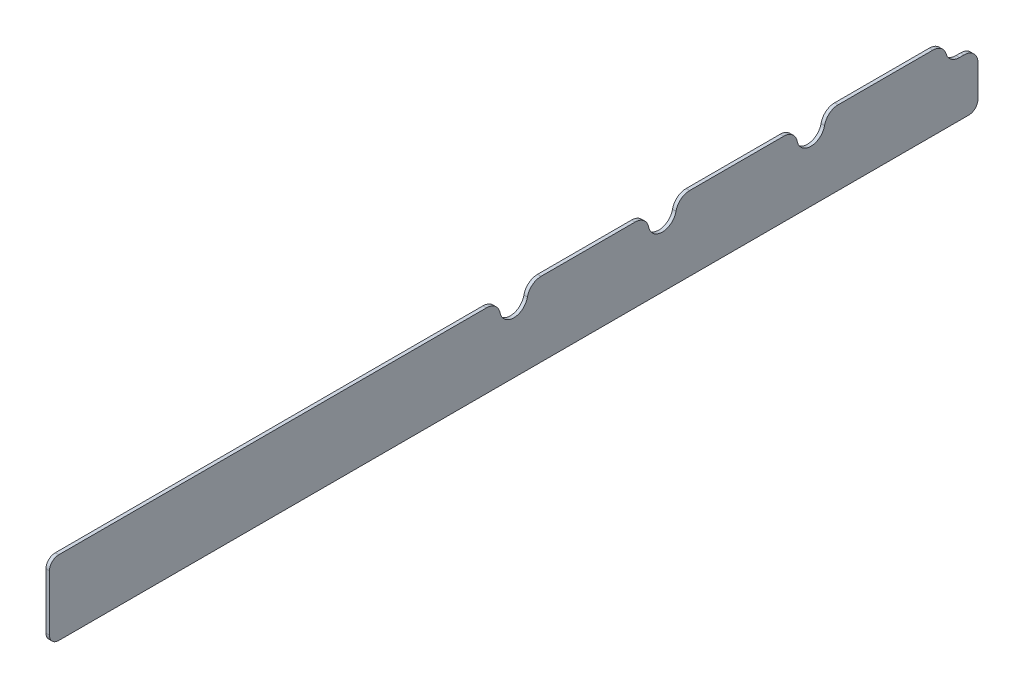
ISO-10303-21;
HEADER;
FILE_DESCRIPTION(('STEP AP214'),'2;1');
FILE_NAME('part.step','',(''),(''),'','','');
FILE_SCHEMA(('AUTOMOTIVE_DESIGN { 1 0 10303 214 1 1 1 1 }'));
ENDSEC;
DATA;
#1=APPLICATION_CONTEXT('core data for automotive mechanical design processes');
#2=APPLICATION_PROTOCOL_DEFINITION('international standard','automotive_design',2000,#1);
#3=PRODUCT_CONTEXT('',#1,'mechanical');
#4=PRODUCT('Part','Part','',(#3));
#5=PRODUCT_RELATED_PRODUCT_CATEGORY('part','',(#4));
#6=PRODUCT_DEFINITION_FORMATION('','',#4);
#7=PRODUCT_DEFINITION_CONTEXT('part definition',#1,'design');
#8=PRODUCT_DEFINITION('design','',#6,#7);
#9=PRODUCT_DEFINITION_SHAPE('','',#8);
#10=(LENGTH_UNIT() NAMED_UNIT(*) SI_UNIT(.MILLI.,.METRE.));
#11=(NAMED_UNIT(*) PLANE_ANGLE_UNIT() SI_UNIT($,.RADIAN.));
#12=(NAMED_UNIT(*) SI_UNIT($,.STERADIAN.) SOLID_ANGLE_UNIT());
#13=UNCERTAINTY_MEASURE_WITH_UNIT(LENGTH_MEASURE(1.E-05),#10,'distance_accuracy_value','');
#14=(GEOMETRIC_REPRESENTATION_CONTEXT(3) GLOBAL_UNCERTAINTY_ASSIGNED_CONTEXT((#13)) GLOBAL_UNIT_ASSIGNED_CONTEXT((#10,
#11,#12)) REPRESENTATION_CONTEXT('',''));
#15=CARTESIAN_POINT('',(0.,0.,0.));
#16=DIRECTION('',(0.,0.,1.));
#17=DIRECTION('',(1.,0.,0.));
#18=AXIS2_PLACEMENT_3D('',#15,#16,#17);
#19=CARTESIAN_POINT('',(-1.1938,12.7,158.75));
#20=DIRECTION('',(0.,1.,0.));
#21=DIRECTION('',(0.,0.,1.));
#22=AXIS2_PLACEMENT_3D('',#19,#20,#21);
#23=PLANE('',#22);
#24=DIRECTION('',(0.,0.,1.));
#25=VECTOR('',#24,1.);
#26=CARTESIAN_POINT('',(0.,12.7,158.75));
#27=LINE('',#26,#25);
#28=CARTESIAN_POINT('',(0.,12.7,-92.264860702164));
#29=VERTEX_POINT('',#28);
#30=CARTESIAN_POINT('',(0.,12.7,-60.1351392978358));
#31=VERTEX_POINT('',#30);
#32=EDGE_CURVE('E265',#29,#31,#27,.T.);
#33=ORIENTED_EDGE('',*,*,#32,.F.);
#34=DIRECTION('',(1.,0.,0.));
#35=VECTOR('',#34,1.);
#36=CARTESIAN_POINT('',(-1.1938,12.7,-92.2648607021641));
#37=LINE('',#36,#35);
#38=CARTESIAN_POINT('',(-1.1938,12.7,-92.264860702164));
#39=VERTEX_POINT('',#38);
#40=EDGE_CURVE('E337',#29,#39,#37,.F.);
#41=ORIENTED_EDGE('',*,*,#40,.T.);
#42=DIRECTION('',(0.,0.,1.));
#43=VECTOR('',#42,1.);
#44=CARTESIAN_POINT('',(-1.1938,12.7,158.75));
#45=LINE('',#44,#43);
#46=CARTESIAN_POINT('',(-1.1938,12.7,-60.1351392978358));
#47=VERTEX_POINT('',#46);
#48=EDGE_CURVE('E252',#39,#47,#45,.T.);
#49=ORIENTED_EDGE('',*,*,#48,.T.);
#50=DIRECTION('',(1.,0.,0.));
#51=VECTOR('',#50,1.);
#52=CARTESIAN_POINT('',(0.,12.7,-60.1351392978359));
#53=LINE('',#52,#51);
#54=EDGE_CURVE('E334',#47,#31,#53,.T.);
#55=ORIENTED_EDGE('',*,*,#54,.T.);
#56=EDGE_LOOP('',(#33,#41,#49,#55));
#57=FACE_BOUND('',#56,.T.);
#58=ADVANCED_FACE('F47',(#57),#23,.T.);
#59=CARTESIAN_POINT('',(0.,12.7,-143.288550766243));
#60=VERTEX_POINT('',#59);
#61=CARTESIAN_POINT('',(0.,12.7,-110.935139297836));
#62=VERTEX_POINT('',#61);
#63=EDGE_CURVE('E262',#60,#62,#27,.T.);
#64=ORIENTED_EDGE('',*,*,#63,.F.);
#65=DIRECTION('',(1.,0.,0.));
#66=VECTOR('',#65,1.);
#67=CARTESIAN_POINT('',(-1.1938,12.7,-143.288550766243));
#68=LINE('',#67,#66);
#69=CARTESIAN_POINT('',(-1.1938,12.7,-143.288550766243));
#70=VERTEX_POINT('',#69);
#71=EDGE_CURVE('E55',#60,#70,#68,.F.);
#72=ORIENTED_EDGE('',*,*,#71,.T.);
#73=CARTESIAN_POINT('',(-1.1938,12.7,-110.935139297836));
#74=VERTEX_POINT('',#73);
#75=EDGE_CURVE('E249',#70,#74,#45,.T.);
#76=ORIENTED_EDGE('',*,*,#75,.T.);
#77=DIRECTION('',(1.,0.,0.));
#78=VECTOR('',#77,1.);
#79=CARTESIAN_POINT('',(0.,12.7,-110.935139297836));
#80=LINE('',#79,#78);
#81=EDGE_CURVE('E354',#74,#62,#80,.T.);
#82=ORIENTED_EDGE('',*,*,#81,.T.);
#83=EDGE_LOOP('',(#64,#72,#76,#82));
#84=FACE_BOUND('',#83,.T.);
#85=ADVANCED_FACE('F368',(#84),#23,.T.);
#86=CARTESIAN_POINT('',(0.,12.7,-41.464860702164));
#87=VERTEX_POINT('',#86);
#88=CARTESIAN_POINT('',(0.,12.7,-9.33513929783583));
#89=VERTEX_POINT('',#88);
#90=EDGE_CURVE('E390',#87,#89,#27,.T.);
#91=ORIENTED_EDGE('',*,*,#90,.F.);
#92=DIRECTION('',(1.,0.,0.));
#93=VECTOR('',#92,1.);
#94=CARTESIAN_POINT('',(-1.1938,12.7,-41.4648607021641));
#95=LINE('',#94,#93);
#96=CARTESIAN_POINT('',(-1.1938,12.7,-41.464860702164));
#97=VERTEX_POINT('',#96);
#98=EDGE_CURVE('E317',#87,#97,#95,.F.);
#99=ORIENTED_EDGE('',*,*,#98,.T.);
#100=CARTESIAN_POINT('',(-1.1938,12.7,-9.33513929783583));
#101=VERTEX_POINT('',#100);
#102=EDGE_CURVE('E405',#97,#101,#45,.T.);
#103=ORIENTED_EDGE('',*,*,#102,.T.);
#104=DIRECTION('',(1.,0.,0.));
#105=VECTOR('',#104,1.);
#106=CARTESIAN_POINT('',(0.,12.7,-9.33513929783589));
#107=LINE('',#106,#105);
#108=EDGE_CURVE('E314',#101,#89,#107,.T.);
#109=ORIENTED_EDGE('',*,*,#108,.T.);
#110=EDGE_LOOP('',(#91,#99,#103,#109));
#111=FACE_BOUND('',#110,.T.);
#112=ADVANCED_FACE('F442',(#111),#23,.T.);
#113=CARTESIAN_POINT('',(-1.1938,-12.7,-158.75));
#114=DIRECTION('',(0.,0.,-1.));
#115=DIRECTION('',(-1.,0.,0.));
#116=AXIS2_PLACEMENT_3D('',#113,#114,#115);
#117=PLANE('',#116);
#118=DIRECTION('',(0.,1.,0.));
#119=VECTOR('',#118,1.);
#120=CARTESIAN_POINT('',(-1.1938,-12.7,-158.75));
#121=LINE('',#120,#119);
#122=CARTESIAN_POINT('',(-1.1938,-9.525,-158.75));
#123=VERTEX_POINT('',#122);
#124=CARTESIAN_POINT('',(-1.1938,1.18866963830967,-158.75));
#125=VERTEX_POINT('',#124);
#126=EDGE_CURVE('E244',#123,#125,#121,.T.);
#127=ORIENTED_EDGE('',*,*,#126,.T.);
#128=DIRECTION('',(-1.,0.,0.));
#129=VECTOR('',#128,1.);
#130=CARTESIAN_POINT('',(0.,1.18866963830967,-158.75));
#131=LINE('',#130,#129);
#132=CARTESIAN_POINT('',(0.,1.18866963830967,-158.75));
#133=VERTEX_POINT('',#132);
#134=EDGE_CURVE('E361',#125,#133,#131,.F.);
#135=ORIENTED_EDGE('',*,*,#134,.T.);
#136=DIRECTION('',(0.,1.,0.));
#137=VECTOR('',#136,1.);
#138=CARTESIAN_POINT('',(0.,-12.7,-158.75));
#139=LINE('',#138,#137);
#140=CARTESIAN_POINT('',(0.,-9.525,-158.75));
#141=VERTEX_POINT('',#140);
#142=EDGE_CURVE('E241',#141,#133,#139,.T.);
#143=ORIENTED_EDGE('',*,*,#142,.F.);
#144=DIRECTION('',(1.,0.,0.));
#145=VECTOR('',#144,1.);
#146=CARTESIAN_POINT('',(-1.1938,-9.525,-158.75));
#147=LINE('',#146,#145);
#148=EDGE_CURVE('E258',#141,#123,#147,.F.);
#149=ORIENTED_EDGE('',*,*,#148,.T.);
#150=EDGE_LOOP('',(#127,#135,#143,#149));
#151=FACE_BOUND('',#150,.T.);
#152=ADVANCED_FACE('F426',(#151),#117,.T.);
#153=CARTESIAN_POINT('',(-1.1938,-12.7,158.75));
#154=DIRECTION('',(0.,-1.,0.));
#155=DIRECTION('',(0.,0.,-1.));
#156=AXIS2_PLACEMENT_3D('',#153,#154,#155);
#157=PLANE('',#156);
#158=DIRECTION('',(0.,0.,-1.));
#159=VECTOR('',#158,1.);
#160=CARTESIAN_POINT('',(0.,-12.7,158.75));
#161=LINE('',#160,#159);
#162=CARTESIAN_POINT('',(0.,-12.7,155.575));
#163=VERTEX_POINT('',#162);
#164=CARTESIAN_POINT('',(0.,-12.7,-155.575));
#165=VERTEX_POINT('',#164);
#166=EDGE_CURVE('E248',#163,#165,#161,.T.);
#167=ORIENTED_EDGE('',*,*,#166,.F.);
#168=DIRECTION('',(1.,0.,0.));
#169=VECTOR('',#168,1.);
#170=CARTESIAN_POINT('',(-1.1938,-12.7,155.575));
#171=LINE('',#170,#169);
#172=CARTESIAN_POINT('',(-1.1938,-12.7,155.575));
#173=VERTEX_POINT('',#172);
#174=EDGE_CURVE('E295',#163,#173,#171,.F.);
#175=ORIENTED_EDGE('',*,*,#174,.T.);
#176=DIRECTION('',(0.,0.,-1.));
#177=VECTOR('',#176,1.);
#178=CARTESIAN_POINT('',(-1.1938,-12.7,158.75));
#179=LINE('',#178,#177);
#180=CARTESIAN_POINT('',(-1.1938,-12.7,-155.575));
#181=VERTEX_POINT('',#180);
#182=EDGE_CURVE('E255',#173,#181,#179,.T.);
#183=ORIENTED_EDGE('',*,*,#182,.T.);
#184=DIRECTION('',(1.,0.,0.));
#185=VECTOR('',#184,1.);
#186=CARTESIAN_POINT('',(-1.1938,-12.7,-155.575));
#187=LINE('',#186,#185);
#188=EDGE_CURVE('E292',#181,#165,#187,.T.);
#189=ORIENTED_EDGE('',*,*,#188,.T.);
#190=EDGE_LOOP('',(#167,#175,#183,#189));
#191=FACE_BOUND('',#190,.T.);
#192=ADVANCED_FACE('F417',(#191),#157,.T.);
#193=CARTESIAN_POINT('',(-1.1938,-12.7,158.75));
#194=DIRECTION('',(0.,0.,1.));
#195=DIRECTION('',(1.,0.,0.));
#196=AXIS2_PLACEMENT_3D('',#193,#194,#195);
#197=PLANE('',#196);
#198=DIRECTION('',(0.,-1.,0.));
#199=VECTOR('',#198,1.);
#200=CARTESIAN_POINT('',(-1.1938,-12.7,158.75));
#201=LINE('',#200,#199);
#202=CARTESIAN_POINT('',(-1.1938,9.525,158.75));
#203=VERTEX_POINT('',#202);
#204=CARTESIAN_POINT('',(-1.1938,-9.525,158.75));
#205=VERTEX_POINT('',#204);
#206=EDGE_CURVE('E251',#203,#205,#201,.T.);
#207=ORIENTED_EDGE('',*,*,#206,.T.);
#208=DIRECTION('',(1.,0.,0.));
#209=VECTOR('',#208,1.);
#210=CARTESIAN_POINT('',(-1.1938,-9.525,158.75));
#211=LINE('',#210,#209);
#212=CARTESIAN_POINT('',(0.,-9.525,158.75));
#213=VERTEX_POINT('',#212);
#214=EDGE_CURVE('E289',#205,#213,#211,.T.);
#215=ORIENTED_EDGE('',*,*,#214,.T.);
#216=DIRECTION('',(0.,-1.,0.));
#217=VECTOR('',#216,1.);
#218=CARTESIAN_POINT('',(0.,-12.7,158.75));
#219=LINE('',#218,#217);
#220=CARTESIAN_POINT('',(0.,9.525,158.75));
#221=VERTEX_POINT('',#220);
#222=EDGE_CURVE('E264',#221,#213,#219,.T.);
#223=ORIENTED_EDGE('',*,*,#222,.F.);
#224=DIRECTION('',(1.,0.,0.));
#225=VECTOR('',#224,1.);
#226=CARTESIAN_POINT('',(-1.1938,9.525,158.75));
#227=LINE('',#226,#225);
#228=EDGE_CURVE('E287',#221,#203,#227,.F.);
#229=ORIENTED_EDGE('',*,*,#228,.T.);
#230=EDGE_LOOP('',(#207,#215,#223,#229));
#231=FACE_BOUND('',#230,.T.);
#232=ADVANCED_FACE('F411',(#231),#197,.T.);
#233=CARTESIAN_POINT('',(0.,12.7,9.33513929783594));
#234=VERTEX_POINT('',#233);
#235=CARTESIAN_POINT('',(0.,12.7,155.575));
#236=VERTEX_POINT('',#235);
#237=EDGE_CURVE('E261',#234,#236,#27,.T.);
#238=ORIENTED_EDGE('',*,*,#237,.F.);
#239=DIRECTION('',(1.,0.,0.));
#240=VECTOR('',#239,1.);
#241=CARTESIAN_POINT('',(-1.1938,12.7,9.33513929783589));
#242=LINE('',#241,#240);
#243=CARTESIAN_POINT('',(-1.1938,12.7,9.33513929783594));
#244=VERTEX_POINT('',#243);
#245=EDGE_CURVE('E297',#234,#244,#242,.F.);
#246=ORIENTED_EDGE('',*,*,#245,.T.);
#247=CARTESIAN_POINT('',(-1.1938,12.7,155.575));
#248=VERTEX_POINT('',#247);
#249=EDGE_CURVE('E247',#244,#248,#45,.T.);
#250=ORIENTED_EDGE('',*,*,#249,.T.);
#251=DIRECTION('',(1.,0.,0.));
#252=VECTOR('',#251,1.);
#253=CARTESIAN_POINT('',(-1.1938,12.7,155.575));
#254=LINE('',#253,#252);
#255=EDGE_CURVE('E277',#248,#236,#254,.T.);
#256=ORIENTED_EDGE('',*,*,#255,.T.);
#257=EDGE_LOOP('',(#238,#246,#250,#256));
#258=FACE_BOUND('',#257,.T.);
#259=ADVANCED_FACE('F403',(#258),#23,.T.);
#260=CARTESIAN_POINT('',(-1.1938,0.,0.));
#261=DIRECTION('',(-1.,0.,0.));
#262=DIRECTION('',(0.,0.,1.));
#263=AXIS2_PLACEMENT_3D('',#260,#261,#262);
#264=PLANE('',#263);
#265=DIRECTION('',(0.,0.,1.));
#266=VECTOR('',#265,1.);
#267=CARTESIAN_POINT('',(-1.1938,5.95116963830967,-152.4));
#268=LINE('',#267,#266);
#269=CARTESIAN_POINT('',(-1.1938,5.95116963830967,-153.9875));
#270=VERTEX_POINT('',#269);
#271=CARTESIAN_POINT('',(-1.1938,5.95116963830967,-152.4));
#272=VERTEX_POINT('',#271);
#273=EDGE_CURVE('E203',#270,#272,#268,.T.);
#274=ORIENTED_EDGE('',*,*,#273,.F.);
#275=CARTESIAN_POINT('',(-1.1938,1.18866963830967,-153.9875));
#276=DIRECTION('',(-1.,0.,0.));
#277=DIRECTION('',(0.,0.,1.));
#278=AXIS2_PLACEMENT_3D('',#275,#276,#277);
#279=CIRCLE('',#278,4.7625);
#280=EDGE_CURVE('E359',#270,#125,#279,.T.);
#281=ORIENTED_EDGE('',*,*,#280,.T.);
#282=ORIENTED_EDGE('',*,*,#126,.F.);
#283=CARTESIAN_POINT('',(-1.1938,-9.525,-155.575));
#284=DIRECTION('',(-1.,0.,0.));
#285=DIRECTION('',(0.,0.,1.));
#286=AXIS2_PLACEMENT_3D('',#283,#284,#285);
#287=CIRCLE('',#286,3.175);
#288=EDGE_CURVE('E283',#123,#181,#287,.T.);
#289=ORIENTED_EDGE('',*,*,#288,.T.);
#290=ORIENTED_EDGE('',*,*,#182,.F.);
#291=CARTESIAN_POINT('',(-1.1938,-9.525,155.575));
#292=DIRECTION('',(-1.,0.,0.));
#293=DIRECTION('',(0.,0.,1.));
#294=AXIS2_PLACEMENT_3D('',#291,#292,#293);
#295=CIRCLE('',#294,3.175);
#296=EDGE_CURVE('E285',#173,#205,#295,.T.);
#297=ORIENTED_EDGE('',*,*,#296,.T.);
#298=ORIENTED_EDGE('',*,*,#206,.F.);
#299=CARTESIAN_POINT('',(-1.1938,9.525,155.575));
#300=DIRECTION('',(-1.,0.,0.));
#301=DIRECTION('',(0.,0.,1.));
#302=AXIS2_PLACEMENT_3D('',#299,#300,#301);
#303=CIRCLE('',#302,3.175);
#304=EDGE_CURVE('E280',#203,#248,#303,.T.);
#305=ORIENTED_EDGE('',*,*,#304,.T.);
#306=ORIENTED_EDGE('',*,*,#249,.F.);
#307=CARTESIAN_POINT('',(-1.1938,7.9375,9.33513929783589));
#308=DIRECTION('',(-1.,0.,0.));
#309=DIRECTION('',(0.,0.,1.));
#310=AXIS2_PLACEMENT_3D('',#307,#308,#309);
#311=CIRCLE('',#310,4.7625);
#312=CARTESIAN_POINT('',(-1.1938,8.88365,4.66756964891795));
#313=VERTEX_POINT('',#312);
#314=EDGE_CURVE('E303',#244,#313,#311,.T.);
#315=ORIENTED_EDGE('',*,*,#314,.T.);
#316=CARTESIAN_POINT('',(-1.1938,9.8298,0.));
#317=DIRECTION('',(-1.,0.,0.));
#318=DIRECTION('',(0.,0.,1.));
#319=AXIS2_PLACEMENT_3D('',#316,#317,#318);
#320=CIRCLE('',#319,4.7625);
#321=CARTESIAN_POINT('',(-1.1938,8.88365,-4.66756964891795));
#322=VERTEX_POINT('',#321);
#323=EDGE_CURVE('E229',#322,#313,#320,.T.);
#324=ORIENTED_EDGE('',*,*,#323,.F.);
#325=CARTESIAN_POINT('',(-1.1938,7.9375,-9.33513929783589));
#326=DIRECTION('',(-1.,0.,0.));
#327=DIRECTION('',(0.,0.,1.));
#328=AXIS2_PLACEMENT_3D('',#325,#326,#327);
#329=CIRCLE('',#328,4.7625);
#330=EDGE_CURVE('E300',#322,#101,#329,.T.);
#331=ORIENTED_EDGE('',*,*,#330,.T.);
#332=ORIENTED_EDGE('',*,*,#102,.F.);
#333=CARTESIAN_POINT('',(-1.1938,7.9375,-41.4648607021641));
#334=DIRECTION('',(-1.,0.,0.));
#335=DIRECTION('',(0.,0.,1.));
#336=AXIS2_PLACEMENT_3D('',#333,#334,#335);
#337=CIRCLE('',#336,4.7625);
#338=CARTESIAN_POINT('',(-1.1938,8.88365,-46.1324303510821));
#339=VERTEX_POINT('',#338);
#340=EDGE_CURVE('E323',#97,#339,#337,.T.);
#341=ORIENTED_EDGE('',*,*,#340,.T.);
#342=CARTESIAN_POINT('',(-1.1938,9.8298,-50.8));
#343=DIRECTION('',(-1.,0.,0.));
#344=DIRECTION('',(0.,0.,1.));
#345=AXIS2_PLACEMENT_3D('',#342,#343,#344);
#346=CIRCLE('',#345,4.7625);
#347=CARTESIAN_POINT('',(-1.1938,8.88365,-55.4675696489179));
#348=VERTEX_POINT('',#347);
#349=EDGE_CURVE('E230',#348,#339,#346,.T.);
#350=ORIENTED_EDGE('',*,*,#349,.F.);
#351=CARTESIAN_POINT('',(-1.1938,7.9375,-60.1351392978359));
#352=DIRECTION('',(-1.,0.,0.));
#353=DIRECTION('',(0.,0.,1.));
#354=AXIS2_PLACEMENT_3D('',#351,#352,#353);
#355=CIRCLE('',#354,4.7625);
#356=EDGE_CURVE('E320',#348,#47,#355,.T.);
#357=ORIENTED_EDGE('',*,*,#356,.T.);
#358=ORIENTED_EDGE('',*,*,#48,.F.);
#359=CARTESIAN_POINT('',(-1.1938,7.9375,-92.2648607021641));
#360=DIRECTION('',(-1.,0.,0.));
#361=DIRECTION('',(0.,0.,1.));
#362=AXIS2_PLACEMENT_3D('',#359,#360,#361);
#363=CIRCLE('',#362,4.7625);
#364=CARTESIAN_POINT('',(-1.1938,8.88365,-96.932430351082));
#365=VERTEX_POINT('',#364);
#366=EDGE_CURVE('E343',#39,#365,#363,.T.);
#367=ORIENTED_EDGE('',*,*,#366,.T.);
#368=CARTESIAN_POINT('',(-1.1938,9.8298,-101.6));
#369=DIRECTION('',(-1.,0.,0.));
#370=DIRECTION('',(0.,0.,1.));
#371=AXIS2_PLACEMENT_3D('',#368,#369,#370);
#372=CIRCLE('',#371,4.7625);
#373=CARTESIAN_POINT('',(-1.1938,8.88365,-106.267569648918));
#374=VERTEX_POINT('',#373);
#375=EDGE_CURVE('E216',#374,#365,#372,.T.);
#376=ORIENTED_EDGE('',*,*,#375,.F.);
#377=CARTESIAN_POINT('',(-1.1938,7.9375,-110.935139297836));
#378=DIRECTION('',(-1.,0.,0.));
#379=DIRECTION('',(0.,0.,1.));
#380=AXIS2_PLACEMENT_3D('',#377,#378,#379);
#381=CIRCLE('',#380,4.7625);
#382=EDGE_CURVE('E340',#374,#74,#381,.T.);
#383=ORIENTED_EDGE('',*,*,#382,.T.);
#384=ORIENTED_EDGE('',*,*,#75,.F.);
#385=CARTESIAN_POINT('',(-1.1938,7.9375,-143.288550766243));
#386=DIRECTION('',(-1.,0.,0.));
#387=DIRECTION('',(0.,0.,1.));
#388=AXIS2_PLACEMENT_3D('',#385,#386,#387);
#389=CIRCLE('',#388,4.7625);
#390=CARTESIAN_POINT('',(-1.1938,9.32558481915483,-147.844275383122));
#391=VERTEX_POINT('',#390);
#392=EDGE_CURVE('E220',#70,#391,#389,.T.);
#393=ORIENTED_EDGE('',*,*,#392,.T.);
#394=CARTESIAN_POINT('',(-1.1938,10.7136696383097,-152.4));
#395=DIRECTION('',(-1.,0.,0.));
#396=DIRECTION('',(0.,0.,1.));
#397=AXIS2_PLACEMENT_3D('',#394,#395,#396);
#398=CIRCLE('',#397,4.7625);
#399=EDGE_CURVE('E212',#272,#391,#398,.T.);
#400=ORIENTED_EDGE('',*,*,#399,.F.);
#401=EDGE_LOOP('',(#274,#281,#282,#289,#290,#297,#298,#305,#306,#315,#324,#331,#332,#341,#350,
#357,#358,#367,#376,#383,#384,#393,#400));
#402=FACE_BOUND('',#401,.T.);
#403=ADVANCED_FACE('F218',(#402),#264,.T.);
#404=CARTESIAN_POINT('',(0.,0.,0.));
#405=DIRECTION('',(-1.,0.,0.));
#406=DIRECTION('',(0.,0.,1.));
#407=AXIS2_PLACEMENT_3D('',#404,#405,#406);
#408=PLANE('',#407);
#409=ORIENTED_EDGE('',*,*,#142,.T.);
#410=CARTESIAN_POINT('',(0.,1.18866963830967,-153.9875));
#411=DIRECTION('',(-1.,0.,0.));
#412=DIRECTION('',(0.,0.,1.));
#413=AXIS2_PLACEMENT_3D('',#410,#411,#412);
#414=CIRCLE('',#413,4.7625);
#415=CARTESIAN_POINT('',(0.,5.95116963830967,-153.9875));
#416=VERTEX_POINT('',#415);
#417=EDGE_CURVE('E364',#133,#416,#414,.F.);
#418=ORIENTED_EDGE('',*,*,#417,.T.);
#419=DIRECTION('',(0.,0.,1.));
#420=VECTOR('',#419,1.);
#421=CARTESIAN_POINT('',(0.,5.95116963830967,-152.4));
#422=LINE('',#421,#420);
#423=CARTESIAN_POINT('',(0.,5.95116963830967,-152.4));
#424=VERTEX_POINT('',#423);
#425=EDGE_CURVE('E221',#416,#424,#422,.T.);
#426=ORIENTED_EDGE('',*,*,#425,.T.);
#427=CARTESIAN_POINT('',(0.,10.7136696383097,-152.4));
#428=DIRECTION('',(-1.,0.,0.));
#429=DIRECTION('',(0.,0.,1.));
#430=AXIS2_PLACEMENT_3D('',#427,#428,#429);
#431=CIRCLE('',#430,4.7625);
#432=CARTESIAN_POINT('',(0.,9.32558481915483,-147.844275383122));
#433=VERTEX_POINT('',#432);
#434=EDGE_CURVE('E215',#424,#433,#431,.T.);
#435=ORIENTED_EDGE('',*,*,#434,.T.);
#436=CARTESIAN_POINT('',(0.,7.9375,-143.288550766243));
#437=DIRECTION('',(-1.,0.,0.));
#438=DIRECTION('',(0.,0.,1.));
#439=AXIS2_PLACEMENT_3D('',#436,#437,#438);
#440=CIRCLE('',#439,4.7625);
#441=EDGE_CURVE('E62',#433,#60,#440,.F.);
#442=ORIENTED_EDGE('',*,*,#441,.T.);
#443=ORIENTED_EDGE('',*,*,#63,.T.);
#444=CARTESIAN_POINT('',(0.,7.9375,-110.935139297836));
#445=DIRECTION('',(-1.,0.,0.));
#446=DIRECTION('',(0.,0.,1.));
#447=AXIS2_PLACEMENT_3D('',#444,#445,#446);
#448=CIRCLE('',#447,4.7625);
#449=CARTESIAN_POINT('',(0.,8.88365,-106.267569648918));
#450=VERTEX_POINT('',#449);
#451=EDGE_CURVE('E350',#62,#450,#448,.F.);
#452=ORIENTED_EDGE('',*,*,#451,.T.);
#453=CARTESIAN_POINT('',(0.,9.8298,-101.6));
#454=DIRECTION('',(-1.,0.,0.));
#455=DIRECTION('',(0.,0.,1.));
#456=AXIS2_PLACEMENT_3D('',#453,#454,#455);
#457=CIRCLE('',#456,4.7625);
#458=CARTESIAN_POINT('',(0.,8.88365,-96.932430351082));
#459=VERTEX_POINT('',#458);
#460=EDGE_CURVE('E233',#450,#459,#457,.T.);
#461=ORIENTED_EDGE('',*,*,#460,.T.);
#462=CARTESIAN_POINT('',(0.,7.9375,-92.2648607021641));
#463=DIRECTION('',(-1.,0.,0.));
#464=DIRECTION('',(0.,0.,1.));
#465=AXIS2_PLACEMENT_3D('',#462,#463,#464);
#466=CIRCLE('',#465,4.7625);
#467=EDGE_CURVE('E352',#459,#29,#466,.F.);
#468=ORIENTED_EDGE('',*,*,#467,.T.);
#469=ORIENTED_EDGE('',*,*,#32,.T.);
#470=CARTESIAN_POINT('',(0.,7.9375,-60.1351392978359));
#471=DIRECTION('',(-1.,0.,0.));
#472=DIRECTION('',(0.,0.,1.));
#473=AXIS2_PLACEMENT_3D('',#470,#471,#472);
#474=CIRCLE('',#473,4.7625);
#475=CARTESIAN_POINT('',(0.,8.88365,-55.4675696489179));
#476=VERTEX_POINT('',#475);
#477=EDGE_CURVE('E330',#31,#476,#474,.F.);
#478=ORIENTED_EDGE('',*,*,#477,.T.);
#479=CARTESIAN_POINT('',(0.,9.8298,-50.8));
#480=DIRECTION('',(-1.,0.,0.));
#481=DIRECTION('',(0.,0.,1.));
#482=AXIS2_PLACEMENT_3D('',#479,#480,#481);
#483=CIRCLE('',#482,4.7625);
#484=CARTESIAN_POINT('',(0.,8.88365,-46.1324303510821));
#485=VERTEX_POINT('',#484);
#486=EDGE_CURVE('E226',#476,#485,#483,.T.);
#487=ORIENTED_EDGE('',*,*,#486,.T.);
#488=CARTESIAN_POINT('',(0.,7.9375,-41.4648607021641));
#489=DIRECTION('',(-1.,0.,0.));
#490=DIRECTION('',(0.,0.,1.));
#491=AXIS2_PLACEMENT_3D('',#488,#489,#490);
#492=CIRCLE('',#491,4.7625);
#493=EDGE_CURVE('E332',#485,#87,#492,.F.);
#494=ORIENTED_EDGE('',*,*,#493,.T.);
#495=ORIENTED_EDGE('',*,*,#90,.T.);
#496=CARTESIAN_POINT('',(0.,7.9375,-9.33513929783589));
#497=DIRECTION('',(-1.,0.,0.));
#498=DIRECTION('',(0.,0.,1.));
#499=AXIS2_PLACEMENT_3D('',#496,#497,#498);
#500=CIRCLE('',#499,4.7625);
#501=CARTESIAN_POINT('',(0.,8.88365,-4.66756964891795));
#502=VERTEX_POINT('',#501);
#503=EDGE_CURVE('E310',#89,#502,#500,.F.);
#504=ORIENTED_EDGE('',*,*,#503,.T.);
#505=CARTESIAN_POINT('',(0.,9.8298,0.));
#506=DIRECTION('',(-1.,0.,0.));
#507=DIRECTION('',(0.,0.,1.));
#508=AXIS2_PLACEMENT_3D('',#505,#506,#507);
#509=CIRCLE('',#508,4.7625);
#510=CARTESIAN_POINT('',(0.,8.88365,4.66756964891795));
#511=VERTEX_POINT('',#510);
#512=EDGE_CURVE('E238',#502,#511,#509,.T.);
#513=ORIENTED_EDGE('',*,*,#512,.T.);
#514=CARTESIAN_POINT('',(0.,7.9375,9.33513929783589));
#515=DIRECTION('',(-1.,0.,0.));
#516=DIRECTION('',(0.,0.,1.));
#517=AXIS2_PLACEMENT_3D('',#514,#515,#516);
#518=CIRCLE('',#517,4.7625);
#519=EDGE_CURVE('E312',#511,#234,#518,.F.);
#520=ORIENTED_EDGE('',*,*,#519,.T.);
#521=ORIENTED_EDGE('',*,*,#237,.T.);
#522=CARTESIAN_POINT('',(0.,9.525,155.575));
#523=DIRECTION('',(-1.,0.,0.));
#524=DIRECTION('',(0.,0.,1.));
#525=AXIS2_PLACEMENT_3D('',#522,#523,#524);
#526=CIRCLE('',#525,3.175);
#527=EDGE_CURVE('E271',#236,#221,#526,.F.);
#528=ORIENTED_EDGE('',*,*,#527,.T.);
#529=ORIENTED_EDGE('',*,*,#222,.T.);
#530=CARTESIAN_POINT('',(0.,-9.525,155.575));
#531=DIRECTION('',(-1.,0.,0.));
#532=DIRECTION('',(0.,0.,1.));
#533=AXIS2_PLACEMENT_3D('',#530,#531,#532);
#534=CIRCLE('',#533,3.175);
#535=EDGE_CURVE('E275',#213,#163,#534,.F.);
#536=ORIENTED_EDGE('',*,*,#535,.T.);
#537=ORIENTED_EDGE('',*,*,#166,.T.);
#538=CARTESIAN_POINT('',(0.,-9.525,-155.575));
#539=DIRECTION('',(-1.,0.,0.));
#540=DIRECTION('',(0.,0.,1.));
#541=AXIS2_PLACEMENT_3D('',#538,#539,#540);
#542=CIRCLE('',#541,3.175);
#543=EDGE_CURVE('E273',#165,#141,#542,.F.);
#544=ORIENTED_EDGE('',*,*,#543,.T.);
#545=EDGE_LOOP('',(#409,#418,#426,#435,#442,#443,#452,#461,#468,#469,#478,#487,#494,#495,#504,
#513,#520,#521,#528,#529,#536,#537,#544));
#546=FACE_BOUND('',#545,.T.);
#547=ADVANCED_FACE('F377',(#546),#408,.F.);
#548=CARTESIAN_POINT('',(-1.1938,-9.525,155.575));
#549=DIRECTION('',(1.,0.,0.));
#550=DIRECTION('',(0.,0.,-1.));
#551=AXIS2_PLACEMENT_3D('',#548,#549,#550);
#552=CYLINDRICAL_SURFACE('',#551,3.175);
#553=ORIENTED_EDGE('',*,*,#296,.F.);
#554=ORIENTED_EDGE('',*,*,#174,.F.);
#555=ORIENTED_EDGE('',*,*,#535,.F.);
#556=ORIENTED_EDGE('',*,*,#214,.F.);
#557=EDGE_LOOP('',(#553,#554,#555,#556));
#558=FACE_BOUND('',#557,.T.);
#559=ADVANCED_FACE('F413',(#558),#552,.T.);
#560=CARTESIAN_POINT('',(-1.1938,-9.525,-155.575));
#561=DIRECTION('',(1.,0.,0.));
#562=DIRECTION('',(0.,0.,-1.));
#563=AXIS2_PLACEMENT_3D('',#560,#561,#562);
#564=CYLINDRICAL_SURFACE('',#563,3.175);
#565=ORIENTED_EDGE('',*,*,#288,.F.);
#566=ORIENTED_EDGE('',*,*,#148,.F.);
#567=ORIENTED_EDGE('',*,*,#543,.F.);
#568=ORIENTED_EDGE('',*,*,#188,.F.);
#569=EDGE_LOOP('',(#565,#566,#567,#568));
#570=FACE_BOUND('',#569,.T.);
#571=ADVANCED_FACE('F421',(#570),#564,.T.);
#572=CARTESIAN_POINT('',(-1.1938,9.525,155.575));
#573=DIRECTION('',(1.,0.,0.));
#574=DIRECTION('',(0.,0.,-1.));
#575=AXIS2_PLACEMENT_3D('',#572,#573,#574);
#576=CYLINDRICAL_SURFACE('',#575,3.175);
#577=ORIENTED_EDGE('',*,*,#304,.F.);
#578=ORIENTED_EDGE('',*,*,#228,.F.);
#579=ORIENTED_EDGE('',*,*,#527,.F.);
#580=ORIENTED_EDGE('',*,*,#255,.F.);
#581=EDGE_LOOP('',(#577,#578,#579,#580));
#582=FACE_BOUND('',#581,.T.);
#583=ADVANCED_FACE('F402',(#582),#576,.T.);
#584=CARTESIAN_POINT('',(0.,9.8298,0.));
#585=DIRECTION('',(-1.,0.,0.));
#586=DIRECTION('',(0.,0.,1.));
#587=AXIS2_PLACEMENT_3D('',#584,#585,#586);
#588=CYLINDRICAL_SURFACE('',#587,4.7625);
#589=ORIENTED_EDGE('',*,*,#323,.T.);
#590=DIRECTION('',(-1.,0.,0.));
#591=VECTOR('',#590,1.);
#592=CARTESIAN_POINT('',(0.,8.88365,4.66756964891795));
#593=LINE('',#592,#591);
#594=EDGE_CURVE('E308',#313,#511,#593,.F.);
#595=ORIENTED_EDGE('',*,*,#594,.T.);
#596=ORIENTED_EDGE('',*,*,#512,.F.);
#597=DIRECTION('',(-1.,0.,0.));
#598=VECTOR('',#597,1.);
#599=CARTESIAN_POINT('',(0.,8.88365,-4.66756964891795));
#600=LINE('',#599,#598);
#601=EDGE_CURVE('E305',#502,#322,#600,.T.);
#602=ORIENTED_EDGE('',*,*,#601,.T.);
#603=EDGE_LOOP('',(#589,#595,#596,#602));
#604=FACE_BOUND('',#603,.T.);
#605=ADVANCED_FACE('F479',(#604),#588,.F.);
#606=CARTESIAN_POINT('',(0.,7.9375,9.33513929783589));
#607=DIRECTION('',(-1.,0.,0.));
#608=DIRECTION('',(0.,0.,1.));
#609=AXIS2_PLACEMENT_3D('',#606,#607,#608);
#610=CYLINDRICAL_SURFACE('',#609,4.7625);
#611=ORIENTED_EDGE('',*,*,#519,.F.);
#612=ORIENTED_EDGE('',*,*,#594,.F.);
#613=ORIENTED_EDGE('',*,*,#314,.F.);
#614=ORIENTED_EDGE('',*,*,#245,.F.);
#615=EDGE_LOOP('',(#611,#612,#613,#614));
#616=FACE_BOUND('',#615,.T.);
#617=ADVANCED_FACE('F482',(#616),#610,.T.);
#618=CARTESIAN_POINT('',(0.,7.9375,-9.33513929783589));
#619=DIRECTION('',(-1.,0.,0.));
#620=DIRECTION('',(0.,0.,1.));
#621=AXIS2_PLACEMENT_3D('',#618,#619,#620);
#622=CYLINDRICAL_SURFACE('',#621,4.7625);
#623=ORIENTED_EDGE('',*,*,#503,.F.);
#624=ORIENTED_EDGE('',*,*,#108,.F.);
#625=ORIENTED_EDGE('',*,*,#330,.F.);
#626=ORIENTED_EDGE('',*,*,#601,.F.);
#627=EDGE_LOOP('',(#623,#624,#625,#626));
#628=FACE_BOUND('',#627,.T.);
#629=ADVANCED_FACE('F476',(#628),#622,.T.);
#630=CARTESIAN_POINT('',(0.,9.8298,-101.6));
#631=DIRECTION('',(-1.,0.,0.));
#632=DIRECTION('',(0.,0.,1.));
#633=AXIS2_PLACEMENT_3D('',#630,#631,#632);
#634=CYLINDRICAL_SURFACE('',#633,4.7625);
#635=ORIENTED_EDGE('',*,*,#375,.T.);
#636=DIRECTION('',(-1.,0.,0.));
#637=VECTOR('',#636,1.);
#638=CARTESIAN_POINT('',(0.,8.88365,-96.932430351082));
#639=LINE('',#638,#637);
#640=EDGE_CURVE('E348',#365,#459,#639,.F.);
#641=ORIENTED_EDGE('',*,*,#640,.T.);
#642=ORIENTED_EDGE('',*,*,#460,.F.);
#643=DIRECTION('',(-1.,0.,0.));
#644=VECTOR('',#643,1.);
#645=CARTESIAN_POINT('',(0.,8.88365,-106.267569648918));
#646=LINE('',#645,#644);
#647=EDGE_CURVE('E345',#450,#374,#646,.T.);
#648=ORIENTED_EDGE('',*,*,#647,.T.);
#649=EDGE_LOOP('',(#635,#641,#642,#648));
#650=FACE_BOUND('',#649,.T.);
#651=ADVANCED_FACE('F380',(#650),#634,.F.);
#652=CARTESIAN_POINT('',(0.,9.8298,-50.8));
#653=DIRECTION('',(-1.,0.,0.));
#654=DIRECTION('',(0.,0.,1.));
#655=AXIS2_PLACEMENT_3D('',#652,#653,#654);
#656=CYLINDRICAL_SURFACE('',#655,4.7625);
#657=ORIENTED_EDGE('',*,*,#349,.T.);
#658=DIRECTION('',(-1.,0.,0.));
#659=VECTOR('',#658,1.);
#660=CARTESIAN_POINT('',(0.,8.88365,-46.1324303510821));
#661=LINE('',#660,#659);
#662=EDGE_CURVE('E328',#339,#485,#661,.F.);
#663=ORIENTED_EDGE('',*,*,#662,.T.);
#664=ORIENTED_EDGE('',*,*,#486,.F.);
#665=DIRECTION('',(-1.,0.,0.));
#666=VECTOR('',#665,1.);
#667=CARTESIAN_POINT('',(0.,8.88365,-55.4675696489179));
#668=LINE('',#667,#666);
#669=EDGE_CURVE('E325',#476,#348,#668,.T.);
#670=ORIENTED_EDGE('',*,*,#669,.T.);
#671=EDGE_LOOP('',(#657,#663,#664,#670));
#672=FACE_BOUND('',#671,.T.);
#673=ADVANCED_FACE('F468',(#672),#656,.F.);
#674=CARTESIAN_POINT('',(0.,7.9375,-41.4648607021641));
#675=DIRECTION('',(-1.,0.,0.));
#676=DIRECTION('',(0.,0.,1.));
#677=AXIS2_PLACEMENT_3D('',#674,#675,#676);
#678=CYLINDRICAL_SURFACE('',#677,4.7625);
#679=ORIENTED_EDGE('',*,*,#493,.F.);
#680=ORIENTED_EDGE('',*,*,#662,.F.);
#681=ORIENTED_EDGE('',*,*,#340,.F.);
#682=ORIENTED_EDGE('',*,*,#98,.F.);
#683=EDGE_LOOP('',(#679,#680,#681,#682));
#684=FACE_BOUND('',#683,.T.);
#685=ADVANCED_FACE('F464',(#684),#678,.T.);
#686=CARTESIAN_POINT('',(0.,7.9375,-60.1351392978359));
#687=DIRECTION('',(-1.,0.,0.));
#688=DIRECTION('',(0.,0.,1.));
#689=AXIS2_PLACEMENT_3D('',#686,#687,#688);
#690=CYLINDRICAL_SURFACE('',#689,4.7625);
#691=ORIENTED_EDGE('',*,*,#477,.F.);
#692=ORIENTED_EDGE('',*,*,#54,.F.);
#693=ORIENTED_EDGE('',*,*,#356,.F.);
#694=ORIENTED_EDGE('',*,*,#669,.F.);
#695=EDGE_LOOP('',(#691,#692,#693,#694));
#696=FACE_BOUND('',#695,.T.);
#697=ADVANCED_FACE('F472',(#696),#690,.T.);
#698=CARTESIAN_POINT('',(0.,7.9375,-92.2648607021641));
#699=DIRECTION('',(-1.,0.,0.));
#700=DIRECTION('',(0.,0.,1.));
#701=AXIS2_PLACEMENT_3D('',#698,#699,#700);
#702=CYLINDRICAL_SURFACE('',#701,4.7625);
#703=ORIENTED_EDGE('',*,*,#467,.F.);
#704=ORIENTED_EDGE('',*,*,#640,.F.);
#705=ORIENTED_EDGE('',*,*,#366,.F.);
#706=ORIENTED_EDGE('',*,*,#40,.F.);
#707=EDGE_LOOP('',(#703,#704,#705,#706));
#708=FACE_BOUND('',#707,.T.);
#709=ADVANCED_FACE('F383',(#708),#702,.T.);
#710=CARTESIAN_POINT('',(0.,7.9375,-110.935139297836));
#711=DIRECTION('',(-1.,0.,0.));
#712=DIRECTION('',(0.,0.,1.));
#713=AXIS2_PLACEMENT_3D('',#710,#711,#712);
#714=CYLINDRICAL_SURFACE('',#713,4.7625);
#715=ORIENTED_EDGE('',*,*,#451,.F.);
#716=ORIENTED_EDGE('',*,*,#81,.F.);
#717=ORIENTED_EDGE('',*,*,#382,.F.);
#718=ORIENTED_EDGE('',*,*,#647,.F.);
#719=EDGE_LOOP('',(#715,#716,#717,#718));
#720=FACE_BOUND('',#719,.T.);
#721=ADVANCED_FACE('F375',(#720),#714,.T.);
#722=CARTESIAN_POINT('',(0.,10.7136696383097,-152.4));
#723=DIRECTION('',(-1.,0.,0.));
#724=DIRECTION('',(0.,0.,1.));
#725=AXIS2_PLACEMENT_3D('',#722,#723,#724);
#726=CYLINDRICAL_SURFACE('',#725,4.7625);
#727=ORIENTED_EDGE('',*,*,#399,.T.);
#728=DIRECTION('',(-1.,0.,0.));
#729=VECTOR('',#728,1.);
#730=CARTESIAN_POINT('',(0.,9.32558481915483,-147.844275383122));
#731=LINE('',#730,#729);
#732=EDGE_CURVE('E11',#391,#433,#731,.F.);
#733=ORIENTED_EDGE('',*,*,#732,.T.);
#734=ORIENTED_EDGE('',*,*,#434,.F.);
#735=DIRECTION('',(-1.,0.,0.));
#736=VECTOR('',#735,1.);
#737=CARTESIAN_POINT('',(0.,5.95116963830967,-152.4));
#738=LINE('',#737,#736);
#739=EDGE_CURVE('E207',#424,#272,#738,.T.);
#740=ORIENTED_EDGE('',*,*,#739,.T.);
#741=EDGE_LOOP('',(#727,#733,#734,#740));
#742=FACE_BOUND('',#741,.T.);
#743=ADVANCED_FACE('F214',(#742),#726,.F.);
#744=CARTESIAN_POINT('',(0.,5.95116963830967,-152.4));
#745=DIRECTION('',(0.,-1.,0.));
#746=DIRECTION('',(0.,0.,-1.));
#747=AXIS2_PLACEMENT_3D('',#744,#745,#746);
#748=PLANE('',#747);
#749=ORIENTED_EDGE('',*,*,#425,.F.);
#750=DIRECTION('',(-1.,0.,0.));
#751=VECTOR('',#750,1.);
#752=CARTESIAN_POINT('',(-1.1938,5.95116963830967,-153.9875));
#753=LINE('',#752,#751);
#754=EDGE_CURVE('E209',#416,#270,#753,.T.);
#755=ORIENTED_EDGE('',*,*,#754,.T.);
#756=ORIENTED_EDGE('',*,*,#273,.T.);
#757=ORIENTED_EDGE('',*,*,#739,.F.);
#758=EDGE_LOOP('',(#749,#755,#756,#757));
#759=FACE_BOUND('',#758,.T.);
#760=ADVANCED_FACE('F206',(#759),#748,.F.);
#761=CARTESIAN_POINT('',(0.,1.18866963830967,-153.9875));
#762=DIRECTION('',(1.,0.,0.));
#763=DIRECTION('',(0.,0.,-1.));
#764=AXIS2_PLACEMENT_3D('',#761,#762,#763);
#765=CYLINDRICAL_SURFACE('',#764,4.7625);
#766=ORIENTED_EDGE('',*,*,#417,.F.);
#767=ORIENTED_EDGE('',*,*,#134,.F.);
#768=ORIENTED_EDGE('',*,*,#280,.F.);
#769=ORIENTED_EDGE('',*,*,#754,.F.);
#770=EDGE_LOOP('',(#766,#767,#768,#769));
#771=FACE_BOUND('',#770,.T.);
#772=ADVANCED_FACE('F430',(#771),#765,.T.);
#773=CARTESIAN_POINT('',(0.,7.9375,-143.288550766243));
#774=DIRECTION('',(-1.,0.,0.));
#775=DIRECTION('',(0.,0.,1.));
#776=AXIS2_PLACEMENT_3D('',#773,#774,#775);
#777=CYLINDRICAL_SURFACE('',#776,4.7625);
#778=ORIENTED_EDGE('',*,*,#441,.F.);
#779=ORIENTED_EDGE('',*,*,#732,.F.);
#780=ORIENTED_EDGE('',*,*,#392,.F.);
#781=ORIENTED_EDGE('',*,*,#71,.F.);
#782=EDGE_LOOP('',(#778,#779,#780,#781));
#783=FACE_BOUND('',#782,.T.);
#784=ADVANCED_FACE('F49',(#783),#777,.T.);
#785=CLOSED_SHELL('',(#58,#85,#112,#152,#192,#232,#259,#403,#547,#559,#571,#583,#605,#617,#629,
#651,#673,#685,#697,#709,#721,#743,#760,#772,#784));
#786=MANIFOLD_SOLID_BREP('B2',#785);
#787=ADVANCED_BREP_SHAPE_REPRESENTATION('',(#18,#786),#14);
#788=SHAPE_DEFINITION_REPRESENTATION(#9,#787);
ENDSEC;
END-ISO-10303-21;
